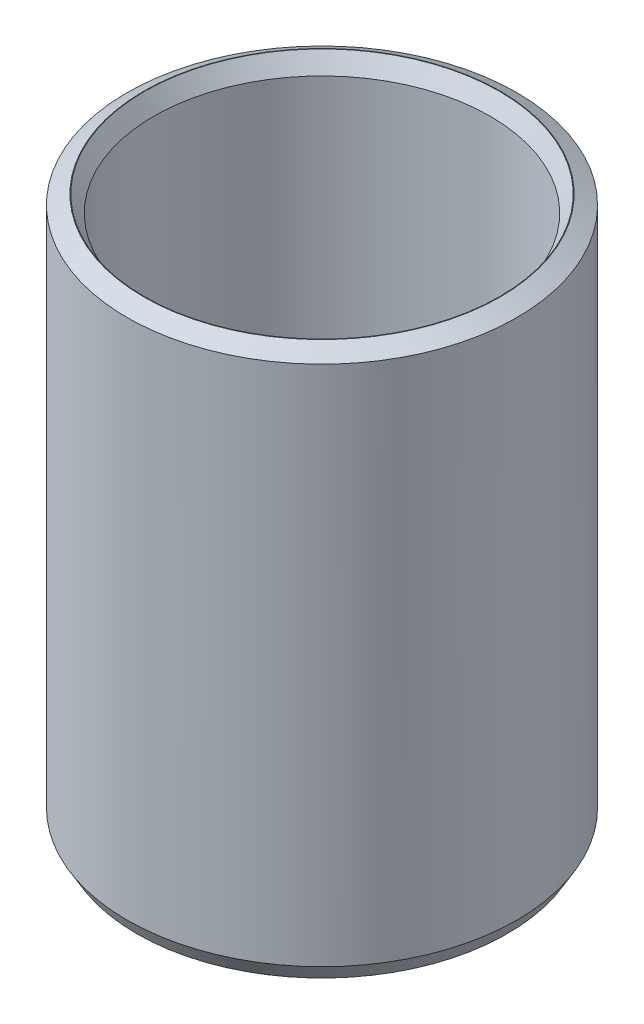
ISO-10303-21;
HEADER;
FILE_DESCRIPTION(('STEP AP214'),'2;1');
FILE_NAME('part.step','',(''),(''),'','','');
FILE_SCHEMA(('AUTOMOTIVE_DESIGN { 1 0 10303 214 1 1 1 1 }'));
ENDSEC;
DATA;
#1=APPLICATION_CONTEXT('core data for automotive mechanical design processes');
#2=APPLICATION_PROTOCOL_DEFINITION('international standard','automotive_design',2000,#1);
#3=PRODUCT_CONTEXT('',#1,'mechanical');
#4=PRODUCT('Part','Part','',(#3));
#5=PRODUCT_RELATED_PRODUCT_CATEGORY('part','',(#4));
#6=PRODUCT_DEFINITION_FORMATION('','',#4);
#7=PRODUCT_DEFINITION_CONTEXT('part definition',#1,'design');
#8=PRODUCT_DEFINITION('design','',#6,#7);
#9=PRODUCT_DEFINITION_SHAPE('','',#8);
#10=(LENGTH_UNIT() NAMED_UNIT(*) SI_UNIT(.MILLI.,.METRE.));
#11=(NAMED_UNIT(*) PLANE_ANGLE_UNIT() SI_UNIT($,.RADIAN.));
#12=(NAMED_UNIT(*) SI_UNIT($,.STERADIAN.) SOLID_ANGLE_UNIT());
#13=UNCERTAINTY_MEASURE_WITH_UNIT(LENGTH_MEASURE(1.E-05),#10,'distance_accuracy_value','');
#14=(GEOMETRIC_REPRESENTATION_CONTEXT(3) GLOBAL_UNCERTAINTY_ASSIGNED_CONTEXT((#13)) GLOBAL_UNIT_ASSIGNED_CONTEXT((#10,
#11,#12)) REPRESENTATION_CONTEXT('',''));
#15=CARTESIAN_POINT('',(0.,0.,0.));
#16=DIRECTION('',(0.,0.,1.));
#17=DIRECTION('',(1.,0.,0.));
#18=AXIS2_PLACEMENT_3D('',#15,#16,#17);
#19=CARTESIAN_POINT('',(0.,133.582892005138,0.));
#20=DIRECTION('',(0.,-1.,0.));
#21=DIRECTION('',(0.,0.,-1.));
#22=AXIS2_PLACEMENT_3D('',#19,#20,#21);
#23=CYLINDRICAL_SURFACE('',#22,47.5);
#24=CARTESIAN_POINT('',(0.,4.04316685312578,0.));
#25=DIRECTION('',(0.,1.,0.));
#26=DIRECTION('',(0.,0.,1.));
#27=AXIS2_PLACEMENT_3D('',#24,#25,#26);
#28=CIRCLE('',#27,47.5);
#29=CARTESIAN_POINT('',(0.,4.04316685312578,47.5));
#30=VERTEX_POINT('',#29);
#31=EDGE_CURVE('E10',#30,#30,#28,.T.);
#32=ORIENTED_EDGE('',*,*,#31,.T.);
#33=EDGE_LOOP('',(#32));
#34=FACE_BOUND('',#33,.T.);
#35=CARTESIAN_POINT('',(0.,131.248568534107,0.));
#36=DIRECTION('',(0.,1.,0.));
#37=DIRECTION('',(0.,0.,1.));
#38=AXIS2_PLACEMENT_3D('',#35,#36,#37);
#39=CIRCLE('',#38,47.5);
#40=CARTESIAN_POINT('',(0.,131.248568534107,-47.5));
#41=VERTEX_POINT('',#40);
#42=EDGE_CURVE('E50',#41,#41,#39,.F.);
#43=ORIENTED_EDGE('',*,*,#42,.T.);
#44=EDGE_LOOP('',(#43));
#45=FACE_BOUND('',#44,.T.);
#46=ADVANCED_FACE('F39',(#34,#45),#23,.T.);
#47=CARTESIAN_POINT('',(0.,133.582892005138,0.));
#48=DIRECTION('',(0.,1.,0.));
#49=DIRECTION('',(0.,0.,1.));
#50=AXIS2_PLACEMENT_3D('',#47,#48,#49);
#51=PLANE('',#50);
#52=CARTESIAN_POINT('',(0.,133.582892005138,0.));
#53=DIRECTION('',(0.,1.,0.));
#54=DIRECTION('',(0.,0.,1.));
#55=AXIS2_PLACEMENT_3D('',#52,#53,#54);
#56=CIRCLE('',#55,43.312866522532);
#57=CARTESIAN_POINT('',(0.,133.582892005138,43.312866522532));
#58=VERTEX_POINT('',#57);
#59=EDGE_CURVE('E58',#58,#58,#56,.F.);
#60=ORIENTED_EDGE('',*,*,#59,.T.);
#61=EDGE_LOOP('',(#60));
#62=FACE_BOUND('',#61,.T.);
#63=CARTESIAN_POINT('',(0.,133.582892005138,0.));
#64=DIRECTION('',(0.,1.,0.));
#65=DIRECTION('',(0.,0.,1.));
#66=AXIS2_PLACEMENT_3D('',#63,#64,#65);
#67=CIRCLE('',#66,43.4568331468743);
#68=CARTESIAN_POINT('',(0.,133.582892005138,-43.4568331468743));
#69=VERTEX_POINT('',#68);
#70=EDGE_CURVE('E61',#69,#69,#67,.T.);
#71=ORIENTED_EDGE('',*,*,#70,.T.);
#72=EDGE_LOOP('',(#71));
#73=FACE_BOUND('',#72,.T.);
#74=ADVANCED_FACE('F88',(#62,#73),#51,.T.);
#75=CARTESIAN_POINT('',(0.,0.,0.));
#76=DIRECTION('',(0.,1.,0.));
#77=DIRECTION('',(0.,0.,1.));
#78=AXIS2_PLACEMENT_3D('',#75,#76,#77);
#79=PLANE('',#78);
#80=CARTESIAN_POINT('',(0.,0.,0.));
#81=DIRECTION('',(0.,1.,0.));
#82=DIRECTION('',(0.,0.,1.));
#83=AXIS2_PLACEMENT_3D('',#80,#81,#82);
#84=CIRCLE('',#83,45.021709904627);
#85=CARTESIAN_POINT('',(0.,0.,-45.021709904627));
#86=VERTEX_POINT('',#85);
#87=EDGE_CURVE('E51',#86,#86,#84,.T.);
#88=ORIENTED_EDGE('',*,*,#87,.T.);
#89=EDGE_LOOP('',(#88));
#90=FACE_BOUND('',#89,.T.);
#91=CARTESIAN_POINT('',(0.,0.,0.));
#92=DIRECTION('',(0.,1.,0.));
#93=DIRECTION('',(0.,0.,1.));
#94=AXIS2_PLACEMENT_3D('',#91,#92,#93);
#95=CIRCLE('',#94,45.1656765289693);
#96=CARTESIAN_POINT('',(0.,0.,45.1656765289693));
#97=VERTEX_POINT('',#96);
#98=EDGE_CURVE('E54',#97,#97,#95,.F.);
#99=ORIENTED_EDGE('',*,*,#98,.T.);
#100=EDGE_LOOP('',(#99));
#101=FACE_BOUND('',#100,.T.);
#102=ADVANCED_FACE('F83',(#90,#101),#79,.F.);
#103=CARTESIAN_POINT('',(0.,133.582892005138,0.));
#104=DIRECTION('',(0.,-1.,0.));
#105=DIRECTION('',(0.,0.,-1.));
#106=AXIS2_PLACEMENT_3D('',#103,#104,#105);
#107=CYLINDRICAL_SURFACE('',#106,40.9785430515012);
#108=CARTESIAN_POINT('',(0.,129.539725152012,0.));
#109=DIRECTION('',(0.,1.,0.));
#110=DIRECTION('',(0.,0.,1.));
#111=AXIS2_PLACEMENT_3D('',#108,#109,#110);
#112=CIRCLE('',#111,40.9785430515012);
#113=CARTESIAN_POINT('',(0.,129.539725152012,40.9785430515012));
#114=VERTEX_POINT('',#113);
#115=EDGE_CURVE('E67',#114,#114,#112,.T.);
#116=ORIENTED_EDGE('',*,*,#115,.T.);
#117=EDGE_LOOP('',(#116));
#118=FACE_BOUND('',#117,.T.);
#119=CARTESIAN_POINT('',(0.,2.33432347103074,0.));
#120=DIRECTION('',(0.,1.,0.));
#121=DIRECTION('',(0.,0.,1.));
#122=AXIS2_PLACEMENT_3D('',#119,#120,#121);
#123=CIRCLE('',#122,40.9785430515012);
#124=CARTESIAN_POINT('',(0.,2.33432347103074,-40.9785430515012));
#125=VERTEX_POINT('',#124);
#126=EDGE_CURVE('E69',#125,#125,#123,.F.);
#127=ORIENTED_EDGE('',*,*,#126,.T.);
#128=EDGE_LOOP('',(#127));
#129=FACE_BOUND('',#128,.T.);
#130=ADVANCED_FACE('F71',(#118,#129),#107,.F.);
#131=CARTESIAN_POINT('',(0.,129.539725152012,0.));
#132=DIRECTION('',(0.,1.,0.));
#133=DIRECTION('',(0.,0.,1.));
#134=AXIS2_PLACEMENT_3D('',#131,#132,#133);
#135=CONICAL_SURFACE('',#134,40.9785430515012,0.523598775598297);
#136=ORIENTED_EDGE('',*,*,#59,.F.);
#137=EDGE_LOOP('',(#136));
#138=FACE_BOUND('',#137,.T.);
#139=ORIENTED_EDGE('',*,*,#115,.F.);
#140=EDGE_LOOP('',(#139));
#141=FACE_BOUND('',#140,.T.);
#142=ADVANCED_FACE('F77',(#138,#141),#135,.F.);
#143=CARTESIAN_POINT('',(0.,0.,0.));
#144=DIRECTION('',(0.,-1.,0.));
#145=DIRECTION('',(0.,0.,-1.));
#146=AXIS2_PLACEMENT_3D('',#143,#144,#145);
#147=CONICAL_SURFACE('',#146,45.021709904627,1.0471975511966);
#148=CARTESIAN_POINT('',(0.,2.33432347103074,-40.9785430515012));
#149=CARTESIAN_POINT('',(0.,2.31000760154084,-41.0206593728879));
#150=CARTESIAN_POINT('',(0.,2.28569173205093,-41.0627756942747));
#151=CARTESIAN_POINT('',(0.,2.23705999307113,-41.1470083370481));
#152=CARTESIAN_POINT('',(0.,2.21274412358122,-41.1891246584349));
#153=CARTESIAN_POINT('',(0.,2.16411238460142,-41.2733573012083));
#154=CARTESIAN_POINT('',(0.,2.13979651511151,-41.315473622595));
#155=CARTESIAN_POINT('',(0.,2.09116477613171,-41.3997062653685));
#156=CARTESIAN_POINT('',(0.,2.0668489066418,-41.4418225867552));
#157=CARTESIAN_POINT('',(0.,2.01821716766199,-41.5260552295287));
#158=CARTESIAN_POINT('',(0.,1.99390129817209,-41.5681715509154));
#159=CARTESIAN_POINT('',(0.,1.94526955919228,-41.6524041936888));
#160=CARTESIAN_POINT('',(0.,1.92095368970238,-41.6945205150756));
#161=CARTESIAN_POINT('',(0.,1.87232195072257,-41.778753157849));
#162=CARTESIAN_POINT('',(0.,1.84800608123267,-41.8208694792358));
#163=CARTESIAN_POINT('',(0.,1.79937434225286,-41.9051021220092));
#164=CARTESIAN_POINT('',(0.,1.77505847276296,-41.9472184433959));
#165=CARTESIAN_POINT('',(0.,1.72642673378315,-42.0314510861694));
#166=CARTESIAN_POINT('',(0.,1.70211086429325,-42.0735674075561));
#167=CARTESIAN_POINT('',(0.,1.65347912531344,-42.1578000503296));
#168=CARTESIAN_POINT('',(0.,1.62916325582354,-42.1999163717163));
#169=CARTESIAN_POINT('',(0.,1.58053151684373,-42.2841490144897));
#170=CARTESIAN_POINT('',(0.,1.55621564735383,-42.3262653358765));
#171=CARTESIAN_POINT('',(0.,1.50758390837402,-42.4104979786499));
#172=CARTESIAN_POINT('',(0.,1.48326803888412,-42.4526143000367));
#173=CARTESIAN_POINT('',(0.,1.43463629990431,-42.5368469428101));
#174=CARTESIAN_POINT('',(0.,1.41032043041441,-42.5789632641968));
#175=CARTESIAN_POINT('',(0.,1.3616886914346,-42.6631959069703));
#176=CARTESIAN_POINT('',(0.,1.3373728219447,-42.705312228357));
#177=CARTESIAN_POINT('',(0.,1.28874108296489,-42.7895448711305));
#178=CARTESIAN_POINT('',(0.,1.26442521347499,-42.8316611925172));
#179=CARTESIAN_POINT('',(0.,1.21579347449518,-42.9158938352907));
#180=CARTESIAN_POINT('',(0.,1.19147760500527,-42.9580101566774));
#181=CARTESIAN_POINT('',(0.,1.14284586602547,-43.0422427994508));
#182=CARTESIAN_POINT('',(0.,1.11852999653556,-43.0843591208376));
#183=CARTESIAN_POINT('',(0.,1.06989825755576,-43.168591763611));
#184=CARTESIAN_POINT('',(0.,1.04558238806585,-43.2107080849977));
#185=CARTESIAN_POINT('',(0.,0.996950649086046,-43.2949407277712));
#186=CARTESIAN_POINT('',(0.,0.972634779596142,-43.3370570491579));
#187=CARTESIAN_POINT('',(0.,0.924003040616335,-43.4212896919314));
#188=CARTESIAN_POINT('',(0.,0.899687171126431,-43.4634060133181));
#189=CARTESIAN_POINT('',(0.,0.851055432146624,-43.5476386560916));
#190=CARTESIAN_POINT('',(0.,0.826739562656721,-43.5897549774783));
#191=CARTESIAN_POINT('',(0.,0.778107823676914,-43.6739876202517));
#192=CARTESIAN_POINT('',(0.,0.75379195418701,-43.7161039416385));
#193=CARTESIAN_POINT('',(0.,0.705160215207203,-43.8003365844119));
#194=CARTESIAN_POINT('',(0.,0.6808443457173,-43.8424529057986));
#195=CARTESIAN_POINT('',(0.,0.632212606737492,-43.9266855485721));
#196=CARTESIAN_POINT('',(0.,0.607896737247589,-43.9688018699588));
#197=CARTESIAN_POINT('',(0.,0.559264998267782,-44.0530345127323));
#198=CARTESIAN_POINT('',(0.,0.534949128777878,-44.095150834119));
#199=CARTESIAN_POINT('',(0.,0.486317389798071,-44.1793834768925));
#200=CARTESIAN_POINT('',(0.,0.462001520308167,-44.2214997982792));
#201=CARTESIAN_POINT('',(0.,0.41336978132836,-44.3057324410526));
#202=CARTESIAN_POINT('',(0.,0.389053911838457,-44.3478487624394));
#203=CARTESIAN_POINT('',(0.,0.34042217285865,-44.4320814052128));
#204=CARTESIAN_POINT('',(0.,0.316106303368746,-44.4741977265995));
#205=CARTESIAN_POINT('',(0.,0.267474564388939,-44.558430369373));
#206=CARTESIAN_POINT('',(0.,0.243158694899036,-44.6005466907597));
#207=CARTESIAN_POINT('',(0.,0.194526955919228,-44.6847793335332));
#208=CARTESIAN_POINT('',(0.,0.170211086429325,-44.7268956549199));
#209=CARTESIAN_POINT('',(0.,0.121579347449518,-44.8111282976934));
#210=CARTESIAN_POINT('',(0.,0.0972634779596142,-44.8532446190801));
#211=CARTESIAN_POINT('',(0.,0.0486317389798071,-44.9374772618535));
#212=CARTESIAN_POINT('',(0.,0.0243158694899036,-44.9795935832403));
#213=CARTESIAN_POINT('',(0.,0.,-45.021709904627));
#214=B_SPLINE_CURVE_WITH_KNOTS('',3,(#148,#149,#150,#151,#152,#153,#154,#155,#156,#157,#158,
#159,#160,#161,#162,#163,#164,#165,#166,#167,#168,#169,#170,#171,#172,#173,#174,#175,#176,#177,
#178,#179,#180,#181,#182,#183,#184,#185,#186,#187,#188,#189,#190,#191,#192,#193,#194,#195,#196,
#197,#198,#199,#200,#201,#202,#203,#204,#205,#206,#207,#208,#209,#210,#211,#212,#213),
.UNSPECIFIED.,.F.,.F.,(4,2,2,2,2,2,2,2,2,2,2,2,2,2,2,2,2,2,2,2,2,2,2,2,2,2,2,2,2,2,2,2,4),(0.,
0.145895216939421,0.291790433878843,0.437685650818264,0.583580867757685,0.729476084697107,
0.875371301636528,1.02126651857595,1.16716173551537,1.31305695245479,1.45895216939421,
1.60484738633363,1.75074260327306,1.89663782021248,2.0425330371519,2.18842825409132,
2.33432347103073,2.48021868797016,2.62611390490958,2.772009121849,2.91790433878842,
3.06379955572784,3.20969477266726,3.35558998960668,3.50148520654611,3.64738042348553,
3.79327564042495,3.93917085736437,4.08506607430379,4.23096129124321,4.37685650818263,
4.52275172512205,4.66864694206148),.UNSPECIFIED.);
#215=EDGE_CURVE('BSEAM73',#125,#86,#214,.T.);
#216=ORIENTED_EDGE('',*,*,#126,.F.);
#217=ORIENTED_EDGE('',*,*,#87,.F.);
#218=ORIENTED_EDGE('',*,*,#215,.T.);
#219=ORIENTED_EDGE('',*,*,#215,.F.);
#220=EDGE_LOOP('',(#216,#218,#217,#219));
#221=FACE_BOUND('',#220,.T.);
#222=ADVANCED_FACE('F73',(#221),#147,.F.);
#223=CARTESIAN_POINT('',(0.,4.04316685312578,0.));
#224=DIRECTION('',(0.,1.,0.));
#225=DIRECTION('',(0.,0.,1.));
#226=AXIS2_PLACEMENT_3D('',#223,#224,#225);
#227=CONICAL_SURFACE('',#226,47.5,0.523598775598302);
#228=ORIENTED_EDGE('',*,*,#98,.F.);
#229=EDGE_LOOP('',(#228));
#230=FACE_BOUND('',#229,.T.);
#231=ORIENTED_EDGE('',*,*,#31,.F.);
#232=EDGE_LOOP('',(#231));
#233=FACE_BOUND('',#232,.T.);
#234=ADVANCED_FACE('F76',(#230,#233),#227,.T.);
#235=CARTESIAN_POINT('',(0.,133.582892005138,0.));
#236=DIRECTION('',(0.,-1.,0.));
#237=DIRECTION('',(0.,0.,-1.));
#238=AXIS2_PLACEMENT_3D('',#235,#236,#237);
#239=CONICAL_SURFACE('',#238,43.4568331468743,1.04719755119659);
#240=CARTESIAN_POINT('',(0.,131.248568534107,-47.5));
#241=CARTESIAN_POINT('',(0.,131.272884403597,-47.4578836786133));
#242=CARTESIAN_POINT('',(0.,131.297200273087,-47.4157673572266));
#243=CARTESIAN_POINT('',(0.,131.345832012066,-47.3315347144531));
#244=CARTESIAN_POINT('',(0.,131.370147881556,-47.2894183930664));
#245=CARTESIAN_POINT('',(0.,131.418779620536,-47.2051857502929));
#246=CARTESIAN_POINT('',(0.,131.443095490026,-47.1630694289062));
#247=CARTESIAN_POINT('',(0.,131.491727229006,-47.0788367861328));
#248=CARTESIAN_POINT('',(0.,131.516043098496,-47.036720464746));
#249=CARTESIAN_POINT('',(0.,131.564674837476,-46.9524878219726));
#250=CARTESIAN_POINT('',(0.,131.588990706965,-46.9103715005859));
#251=CARTESIAN_POINT('',(0.,131.637622445945,-46.8261388578124));
#252=CARTESIAN_POINT('',(0.,131.661938315435,-46.7840225364257));
#253=CARTESIAN_POINT('',(0.,131.710570054415,-46.6997898936522));
#254=CARTESIAN_POINT('',(0.,131.734885923905,-46.6576735722655));
#255=CARTESIAN_POINT('',(0.,131.783517662885,-46.5734409294921));
#256=CARTESIAN_POINT('',(0.,131.807833532375,-46.5313246081053));
#257=CARTESIAN_POINT('',(0.,131.856465271354,-46.4470919653319));
#258=CARTESIAN_POINT('',(0.,131.880781140844,-46.4049756439451));
#259=CARTESIAN_POINT('',(0.,131.929412879824,-46.3207430011717));
#260=CARTESIAN_POINT('',(0.,131.953728749314,-46.278626679785));
#261=CARTESIAN_POINT('',(0.,132.002360488294,-46.1943940370115));
#262=CARTESIAN_POINT('',(0.,132.026676357784,-46.1522777156248));
#263=CARTESIAN_POINT('',(0.,132.075308096764,-46.0680450728513));
#264=CARTESIAN_POINT('',(0.,132.099623966253,-46.0259287514646));
#265=CARTESIAN_POINT('',(0.,132.148255705233,-45.9416961086912));
#266=CARTESIAN_POINT('',(0.,132.172571574723,-45.8995797873044));
#267=CARTESIAN_POINT('',(0.,132.221203313703,-45.815347144531));
#268=CARTESIAN_POINT('',(0.,132.245519183193,-45.7732308231443));
#269=CARTESIAN_POINT('',(0.,132.294150922173,-45.6889981803708));
#270=CARTESIAN_POINT('',(0.,132.318466791663,-45.6468818589841));
#271=CARTESIAN_POINT('',(0.,132.367098530642,-45.5626492162106));
#272=CARTESIAN_POINT('',(0.,132.391414400132,-45.5205328948239));
#273=CARTESIAN_POINT('',(0.,132.440046139112,-45.4363002520504));
#274=CARTESIAN_POINT('',(0.,132.464362008602,-45.3941839306637));
#275=CARTESIAN_POINT('',(0.,132.512993747582,-45.3099512878903));
#276=CARTESIAN_POINT('',(0.,132.537309617072,-45.2678349665035));
#277=CARTESIAN_POINT('',(0.,132.585941356052,-45.1836023237301));
#278=CARTESIAN_POINT('',(0.,132.610257225541,-45.1414860023434));
#279=CARTESIAN_POINT('',(0.,132.658888964521,-45.0572533595699));
#280=CARTESIAN_POINT('',(0.,132.683204834011,-45.0151370381832));
#281=CARTESIAN_POINT('',(0.,132.731836572991,-44.9309043954097));
#282=CARTESIAN_POINT('',(0.,132.756152442481,-44.888788074023));
#283=CARTESIAN_POINT('',(0.,132.804784181461,-44.8045554312496));
#284=CARTESIAN_POINT('',(0.,132.829100050951,-44.7624391098628));
#285=CARTESIAN_POINT('',(0.,132.87773178993,-44.6782064670894));
#286=CARTESIAN_POINT('',(0.,132.90204765942,-44.6360901457026));
#287=CARTESIAN_POINT('',(0.,132.9506793984,-44.5518575029292));
#288=CARTESIAN_POINT('',(0.,132.97499526789,-44.5097411815425));
#289=CARTESIAN_POINT('',(0.,133.02362700687,-44.425508538769));
#290=CARTESIAN_POINT('',(0.,133.04794287636,-44.3833922173823));
#291=CARTESIAN_POINT('',(0.,133.096574615339,-44.2991595746088));
#292=CARTESIAN_POINT('',(0.,133.120890484829,-44.2570432532221));
#293=CARTESIAN_POINT('',(0.,133.169522223809,-44.1728106104487));
#294=CARTESIAN_POINT('',(0.,133.193838093299,-44.1306942890619));
#295=CARTESIAN_POINT('',(0.,133.242469832279,-44.0464616462885));
#296=CARTESIAN_POINT('',(0.,133.266785701769,-44.0043453249017));
#297=CARTESIAN_POINT('',(0.,133.315417440749,-43.9201126821283));
#298=CARTESIAN_POINT('',(0.,133.339733310239,-43.8779963607416));
#299=CARTESIAN_POINT('',(0.,133.388365049218,-43.7937637179681));
#300=CARTESIAN_POINT('',(0.,133.412680918708,-43.7516473965814));
#301=CARTESIAN_POINT('',(0.,133.461312657688,-43.6674147538079));
#302=CARTESIAN_POINT('',(0.,133.485628527178,-43.6252984324212));
#303=CARTESIAN_POINT('',(0.,133.534260266158,-43.5410657896478));
#304=CARTESIAN_POINT('',(0.,133.558576135648,-43.498949468261));
#305=CARTESIAN_POINT('',(0.,133.582892005138,-43.4568331468743));
#306=B_SPLINE_CURVE_WITH_KNOTS('',3,(#240,#241,#242,#243,#244,#245,#246,#247,#248,#249,#250,
#251,#252,#253,#254,#255,#256,#257,#258,#259,#260,#261,#262,#263,#264,#265,#266,#267,#268,#269,
#270,#271,#272,#273,#274,#275,#276,#277,#278,#279,#280,#281,#282,#283,#284,#285,#286,#287,#288,
#289,#290,#291,#292,#293,#294,#295,#296,#297,#298,#299,#300,#301,#302,#303,#304,#305),
.UNSPECIFIED.,.F.,.F.,(4,2,2,2,2,2,2,2,2,2,2,2,2,2,2,2,2,2,2,2,2,2,2,2,2,2,2,2,2,2,2,2,4),(0.,
0.145895216939434,0.291790433878855,0.437685650818275,0.58358086775769,0.72947608469711,
0.875371301636531,1.02126651857595,1.16716173551537,1.31305695245479,1.45895216939421,
1.60484738633362,1.75074260327304,1.89663782021246,2.04253303715188,2.1884282540913,
2.33432347103072,2.48021868797015,2.62611390490957,2.77200912184899,2.91790433878841,
3.06379955572783,3.20969477266724,3.35558998960666,3.50148520654608,3.6473804234855,
3.79327564042492,3.93917085736434,4.08506607430376,4.23096129124317,4.37685650818259,
4.52275172512201,4.66864694206145),.UNSPECIFIED.);
#307=EDGE_CURVE('BSEAM45',#41,#69,#306,.T.);
#308=ORIENTED_EDGE('',*,*,#42,.F.);
#309=ORIENTED_EDGE('',*,*,#70,.F.);
#310=ORIENTED_EDGE('',*,*,#307,.T.);
#311=ORIENTED_EDGE('',*,*,#307,.F.);
#312=EDGE_LOOP('',(#308,#310,#309,#311));
#313=FACE_BOUND('',#312,.T.);
#314=ADVANCED_FACE('F45',(#313),#239,.T.);
#315=CLOSED_SHELL('',(#46,#74,#102,#130,#142,#222,#234,#314));
#316=MANIFOLD_SOLID_BREP('B2',#315);
#317=ADVANCED_BREP_SHAPE_REPRESENTATION('',(#18,#316),#14);
#318=SHAPE_DEFINITION_REPRESENTATION(#9,#317);
ENDSEC;
END-ISO-10303-21;
